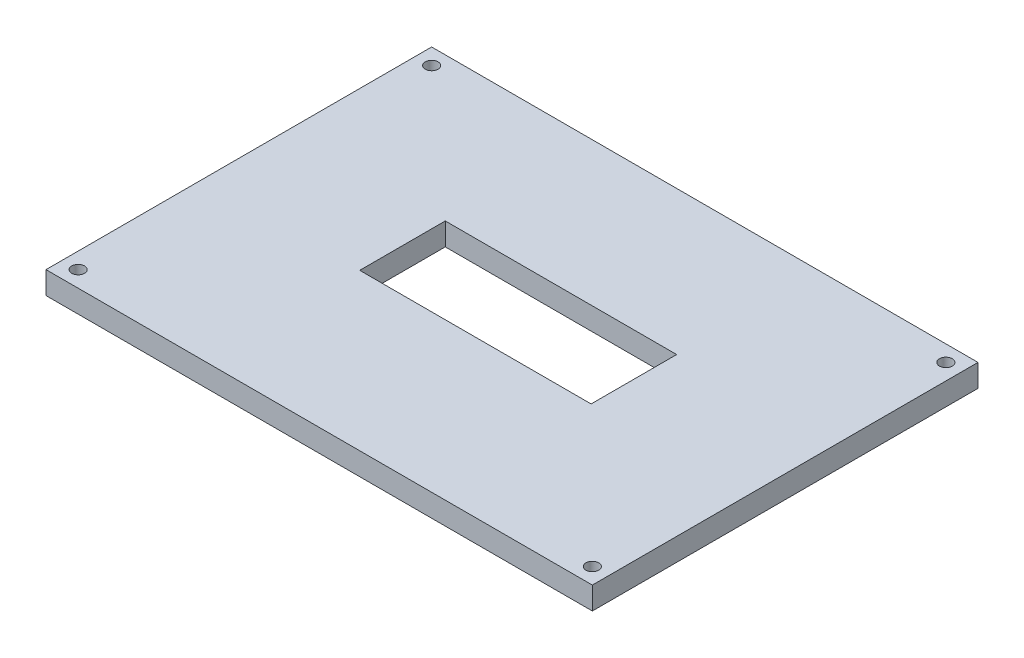
ISO-10303-21;
HEADER;
FILE_DESCRIPTION(('STEP AP214'),'2;1');
FILE_NAME('part.step','',(''),(''),'','','');
FILE_SCHEMA(('AUTOMOTIVE_DESIGN { 1 0 10303 214 1 1 1 1 }'));
ENDSEC;
DATA;
#1=APPLICATION_CONTEXT('core data for automotive mechanical design processes');
#2=APPLICATION_PROTOCOL_DEFINITION('international standard','automotive_design',2000,#1);
#3=PRODUCT_CONTEXT('',#1,'mechanical');
#4=PRODUCT('Part','Part','',(#3));
#5=PRODUCT_RELATED_PRODUCT_CATEGORY('part','',(#4));
#6=PRODUCT_DEFINITION_FORMATION('','',#4);
#7=PRODUCT_DEFINITION_CONTEXT('part definition',#1,'design');
#8=PRODUCT_DEFINITION('design','',#6,#7);
#9=PRODUCT_DEFINITION_SHAPE('','',#8);
#10=(LENGTH_UNIT() NAMED_UNIT(*) SI_UNIT(.MILLI.,.METRE.));
#11=(NAMED_UNIT(*) PLANE_ANGLE_UNIT() SI_UNIT($,.RADIAN.));
#12=(NAMED_UNIT(*) SI_UNIT($,.STERADIAN.) SOLID_ANGLE_UNIT());
#13=UNCERTAINTY_MEASURE_WITH_UNIT(LENGTH_MEASURE(1.E-05),#10,'distance_accuracy_value','');
#14=(GEOMETRIC_REPRESENTATION_CONTEXT(3) GLOBAL_UNCERTAINTY_ASSIGNED_CONTEXT((#13)) GLOBAL_UNIT_ASSIGNED_CONTEXT((#10,
#11,#12)) REPRESENTATION_CONTEXT('',''));
#15=CARTESIAN_POINT('',(0.,0.,0.));
#16=DIRECTION('',(0.,0.,1.));
#17=DIRECTION('',(1.,0.,0.));
#18=AXIS2_PLACEMENT_3D('',#15,#16,#17);
#19=CARTESIAN_POINT('',(-85.,7.,60.));
#20=DIRECTION('',(1.,0.,0.));
#21=DIRECTION('',(0.,0.,-1.));
#22=AXIS2_PLACEMENT_3D('',#19,#20,#21);
#23=PLANE('',#22);
#24=DIRECTION('',(0.,0.,1.));
#25=VECTOR('',#24,1.);
#26=CARTESIAN_POINT('',(-85.,0.,60.));
#27=LINE('',#26,#25);
#28=CARTESIAN_POINT('',(-85.,0.,-60.));
#29=VERTEX_POINT('',#28);
#30=CARTESIAN_POINT('',(-85.,0.,60.));
#31=VERTEX_POINT('',#30);
#32=EDGE_CURVE('E139',#29,#31,#27,.T.);
#33=ORIENTED_EDGE('',*,*,#32,.T.);
#34=DIRECTION('',(0.,-1.,0.));
#35=VECTOR('',#34,1.);
#36=CARTESIAN_POINT('',(-85.,7.,60.));
#37=LINE('',#36,#35);
#38=CARTESIAN_POINT('',(-85.,7.,60.));
#39=VERTEX_POINT('',#38);
#40=EDGE_CURVE('E11',#39,#31,#37,.T.);
#41=ORIENTED_EDGE('',*,*,#40,.F.);
#42=DIRECTION('',(0.,0.,1.));
#43=VECTOR('',#42,1.);
#44=CARTESIAN_POINT('',(-85.,7.,60.));
#45=LINE('',#44,#43);
#46=CARTESIAN_POINT('',(-85.,7.,-60.));
#47=VERTEX_POINT('',#46);
#48=EDGE_CURVE('E143',#47,#39,#45,.T.);
#49=ORIENTED_EDGE('',*,*,#48,.F.);
#50=DIRECTION('',(0.,-1.,0.));
#51=VECTOR('',#50,1.);
#52=CARTESIAN_POINT('',(-85.,7.,-60.));
#53=LINE('',#52,#51);
#54=EDGE_CURVE('E153',#47,#29,#53,.T.);
#55=ORIENTED_EDGE('',*,*,#54,.T.);
#56=EDGE_LOOP('',(#33,#41,#49,#55));
#57=FACE_BOUND('',#56,.T.);
#58=ADVANCED_FACE('F36',(#57),#23,.F.);
#59=CARTESIAN_POINT('',(85.,7.,60.));
#60=DIRECTION('',(0.,0.,-1.));
#61=DIRECTION('',(-1.,0.,0.));
#62=AXIS2_PLACEMENT_3D('',#59,#60,#61);
#63=PLANE('',#62);
#64=DIRECTION('',(1.,0.,0.));
#65=VECTOR('',#64,1.);
#66=CARTESIAN_POINT('',(85.,0.,60.));
#67=LINE('',#66,#65);
#68=CARTESIAN_POINT('',(85.,0.,60.));
#69=VERTEX_POINT('',#68);
#70=EDGE_CURVE('E156',#31,#69,#67,.T.);
#71=ORIENTED_EDGE('',*,*,#70,.T.);
#72=DIRECTION('',(0.,-1.,0.));
#73=VECTOR('',#72,1.);
#74=CARTESIAN_POINT('',(85.,7.,60.));
#75=LINE('',#74,#73);
#76=CARTESIAN_POINT('',(85.,7.,60.));
#77=VERTEX_POINT('',#76);
#78=EDGE_CURVE('E44',#77,#69,#75,.T.);
#79=ORIENTED_EDGE('',*,*,#78,.F.);
#80=DIRECTION('',(1.,0.,0.));
#81=VECTOR('',#80,1.);
#82=CARTESIAN_POINT('',(85.,7.,60.));
#83=LINE('',#82,#81);
#84=EDGE_CURVE('E146',#39,#77,#83,.T.);
#85=ORIENTED_EDGE('',*,*,#84,.F.);
#86=ORIENTED_EDGE('',*,*,#40,.T.);
#87=EDGE_LOOP('',(#71,#79,#85,#86));
#88=FACE_BOUND('',#87,.T.);
#89=ADVANCED_FACE('F209',(#88),#63,.F.);
#90=CARTESIAN_POINT('',(85.,7.,60.));
#91=DIRECTION('',(-1.,0.,0.));
#92=DIRECTION('',(0.,0.,1.));
#93=AXIS2_PLACEMENT_3D('',#90,#91,#92);
#94=PLANE('',#93);
#95=DIRECTION('',(0.,0.,-1.));
#96=VECTOR('',#95,1.);
#97=CARTESIAN_POINT('',(85.,0.,60.));
#98=LINE('',#97,#96);
#99=CARTESIAN_POINT('',(85.,0.,-60.));
#100=VERTEX_POINT('',#99);
#101=EDGE_CURVE('E158',#69,#100,#98,.T.);
#102=ORIENTED_EDGE('',*,*,#101,.T.);
#103=DIRECTION('',(0.,-1.,0.));
#104=VECTOR('',#103,1.);
#105=CARTESIAN_POINT('',(85.,7.,-60.));
#106=LINE('',#105,#104);
#107=CARTESIAN_POINT('',(85.,7.,-60.));
#108=VERTEX_POINT('',#107);
#109=EDGE_CURVE('E163',#108,#100,#106,.T.);
#110=ORIENTED_EDGE('',*,*,#109,.F.);
#111=DIRECTION('',(0.,0.,-1.));
#112=VECTOR('',#111,1.);
#113=CARTESIAN_POINT('',(85.,7.,60.));
#114=LINE('',#113,#112);
#115=EDGE_CURVE('E149',#77,#108,#114,.T.);
#116=ORIENTED_EDGE('',*,*,#115,.F.);
#117=ORIENTED_EDGE('',*,*,#78,.T.);
#118=EDGE_LOOP('',(#102,#110,#116,#117));
#119=FACE_BOUND('',#118,.T.);
#120=ADVANCED_FACE('F214',(#119),#94,.F.);
#121=CARTESIAN_POINT('',(85.,7.,-60.));
#122=DIRECTION('',(0.,0.,1.));
#123=DIRECTION('',(1.,0.,0.));
#124=AXIS2_PLACEMENT_3D('',#121,#122,#123);
#125=PLANE('',#124);
#126=DIRECTION('',(-1.,0.,0.));
#127=VECTOR('',#126,1.);
#128=CARTESIAN_POINT('',(85.,0.,-60.));
#129=LINE('',#128,#127);
#130=EDGE_CURVE('E147',#100,#29,#129,.T.);
#131=ORIENTED_EDGE('',*,*,#130,.T.);
#132=ORIENTED_EDGE('',*,*,#54,.F.);
#133=DIRECTION('',(-1.,0.,0.));
#134=VECTOR('',#133,1.);
#135=CARTESIAN_POINT('',(85.,7.,-60.));
#136=LINE('',#135,#134);
#137=EDGE_CURVE('E151',#108,#47,#136,.T.);
#138=ORIENTED_EDGE('',*,*,#137,.F.);
#139=ORIENTED_EDGE('',*,*,#109,.T.);
#140=EDGE_LOOP('',(#131,#132,#138,#139));
#141=FACE_BOUND('',#140,.T.);
#142=ADVANCED_FACE('F196',(#141),#125,.F.);
#143=CARTESIAN_POINT('',(0.,7.,0.));
#144=DIRECTION('',(0.,1.,0.));
#145=DIRECTION('',(0.,0.,1.));
#146=AXIS2_PLACEMENT_3D('',#143,#144,#145);
#147=PLANE('',#146);
#148=CARTESIAN_POINT('',(80.,7.,55.));
#149=DIRECTION('',(0.,1.,0.));
#150=DIRECTION('',(0.,0.,1.));
#151=AXIS2_PLACEMENT_3D('',#148,#149,#150);
#152=CIRCLE('',#151,2.);
#153=CARTESIAN_POINT('',(80.,7.,57.));
#154=VERTEX_POINT('',#153);
#155=EDGE_CURVE('E183',#154,#154,#152,.T.);
#156=ORIENTED_EDGE('',*,*,#155,.F.);
#157=EDGE_LOOP('',(#156));
#158=FACE_BOUND('',#157,.T.);
#159=CARTESIAN_POINT('',(80.,7.,-55.));
#160=DIRECTION('',(0.,1.,0.));
#161=DIRECTION('',(0.,0.,1.));
#162=AXIS2_PLACEMENT_3D('',#159,#160,#161);
#163=CIRCLE('',#162,2.);
#164=CARTESIAN_POINT('',(80.,7.,-53.));
#165=VERTEX_POINT('',#164);
#166=EDGE_CURVE('E173',#165,#165,#163,.T.);
#167=ORIENTED_EDGE('',*,*,#166,.F.);
#168=EDGE_LOOP('',(#167));
#169=FACE_BOUND('',#168,.T.);
#170=CARTESIAN_POINT('',(-80.,7.,55.));
#171=DIRECTION('',(0.,1.,0.));
#172=DIRECTION('',(0.,0.,1.));
#173=AXIS2_PLACEMENT_3D('',#170,#171,#172);
#174=CIRCLE('',#173,2.);
#175=CARTESIAN_POINT('',(-80.,7.,57.));
#176=VERTEX_POINT('',#175);
#177=EDGE_CURVE('E170',#176,#176,#174,.T.);
#178=ORIENTED_EDGE('',*,*,#177,.F.);
#179=EDGE_LOOP('',(#178));
#180=FACE_BOUND('',#179,.T.);
#181=CARTESIAN_POINT('',(-80.,7.,-55.));
#182=DIRECTION('',(0.,1.,0.));
#183=DIRECTION('',(0.,0.,1.));
#184=AXIS2_PLACEMENT_3D('',#181,#182,#183);
#185=CIRCLE('',#184,2.);
#186=CARTESIAN_POINT('',(-80.,7.,-53.));
#187=VERTEX_POINT('',#186);
#188=EDGE_CURVE('E126',#187,#187,#185,.T.);
#189=ORIENTED_EDGE('',*,*,#188,.F.);
#190=EDGE_LOOP('',(#189));
#191=FACE_BOUND('',#190,.T.);
#192=DIRECTION('',(0.,0.,-1.));
#193=VECTOR('',#192,1.);
#194=CARTESIAN_POINT('',(36.,7.,-15.2367721667));
#195=LINE('',#194,#193);
#196=CARTESIAN_POINT('',(36.,7.,11.3837952969598));
#197=VERTEX_POINT('',#196);
#198=CARTESIAN_POINT('',(36.,7.,-15.2367721667));
#199=VERTEX_POINT('',#198);
#200=EDGE_CURVE('E52',#197,#199,#195,.T.);
#201=ORIENTED_EDGE('',*,*,#200,.F.);
#202=DIRECTION('',(1.,0.,0.));
#203=VECTOR('',#202,1.);
#204=CARTESIAN_POINT('',(-36.,7.,11.3837952969598));
#205=LINE('',#204,#203);
#206=CARTESIAN_POINT('',(-36.,7.,11.3837952969598));
#207=VERTEX_POINT('',#206);
#208=EDGE_CURVE('E120',#207,#197,#205,.T.);
#209=ORIENTED_EDGE('',*,*,#208,.F.);
#210=DIRECTION('',(0.,0.,1.));
#211=VECTOR('',#210,1.);
#212=CARTESIAN_POINT('',(-36.,7.,-15.2367721667));
#213=LINE('',#212,#211);
#214=CARTESIAN_POINT('',(-36.,7.,-15.2367721667));
#215=VERTEX_POINT('',#214);
#216=EDGE_CURVE('E123',#215,#207,#213,.T.);
#217=ORIENTED_EDGE('',*,*,#216,.F.);
#218=DIRECTION('',(-1.,0.,0.));
#219=VECTOR('',#218,1.);
#220=CARTESIAN_POINT('',(-36.,7.,-15.2367721667));
#221=LINE('',#220,#219);
#222=EDGE_CURVE('E132',#199,#215,#221,.T.);
#223=ORIENTED_EDGE('',*,*,#222,.F.);
#224=EDGE_LOOP('',(#201,#209,#217,#223));
#225=FACE_BOUND('',#224,.T.);
#226=ORIENTED_EDGE('',*,*,#48,.T.);
#227=ORIENTED_EDGE('',*,*,#84,.T.);
#228=ORIENTED_EDGE('',*,*,#115,.T.);
#229=ORIENTED_EDGE('',*,*,#137,.T.);
#230=EDGE_LOOP('',(#226,#227,#228,#229));
#231=FACE_BOUND('',#230,.T.);
#232=ADVANCED_FACE('F193',(#158,#169,#180,#191,#225,#231),#147,.T.);
#233=CARTESIAN_POINT('',(0.,0.,0.));
#234=DIRECTION('',(0.,1.,0.));
#235=DIRECTION('',(0.,0.,1.));
#236=AXIS2_PLACEMENT_3D('',#233,#234,#235);
#237=PLANE('',#236);
#238=CARTESIAN_POINT('',(80.,0.,55.));
#239=DIRECTION('',(0.,1.,0.));
#240=DIRECTION('',(0.,0.,1.));
#241=AXIS2_PLACEMENT_3D('',#238,#239,#240);
#242=CIRCLE('',#241,2.);
#243=CARTESIAN_POINT('',(80.,0.,57.));
#244=VERTEX_POINT('',#243);
#245=EDGE_CURVE('E39',#244,#244,#242,.T.);
#246=ORIENTED_EDGE('',*,*,#245,.T.);
#247=EDGE_LOOP('',(#246));
#248=FACE_BOUND('',#247,.T.);
#249=CARTESIAN_POINT('',(80.,0.,-55.));
#250=DIRECTION('',(0.,1.,0.));
#251=DIRECTION('',(0.,0.,1.));
#252=AXIS2_PLACEMENT_3D('',#249,#250,#251);
#253=CIRCLE('',#252,2.);
#254=CARTESIAN_POINT('',(80.,0.,-53.));
#255=VERTEX_POINT('',#254);
#256=EDGE_CURVE('E171',#255,#255,#253,.T.);
#257=ORIENTED_EDGE('',*,*,#256,.T.);
#258=EDGE_LOOP('',(#257));
#259=FACE_BOUND('',#258,.T.);
#260=CARTESIAN_POINT('',(-80.,0.,55.));
#261=DIRECTION('',(0.,1.,0.));
#262=DIRECTION('',(0.,0.,1.));
#263=AXIS2_PLACEMENT_3D('',#260,#261,#262);
#264=CIRCLE('',#263,2.);
#265=CARTESIAN_POINT('',(-80.,0.,57.));
#266=VERTEX_POINT('',#265);
#267=EDGE_CURVE('E168',#266,#266,#264,.T.);
#268=ORIENTED_EDGE('',*,*,#267,.T.);
#269=EDGE_LOOP('',(#268));
#270=FACE_BOUND('',#269,.T.);
#271=CARTESIAN_POINT('',(-80.,0.,-55.));
#272=DIRECTION('',(0.,1.,0.));
#273=DIRECTION('',(0.,0.,1.));
#274=AXIS2_PLACEMENT_3D('',#271,#272,#273);
#275=CIRCLE('',#274,2.);
#276=CARTESIAN_POINT('',(-80.,0.,-53.));
#277=VERTEX_POINT('',#276);
#278=EDGE_CURVE('E133',#277,#277,#275,.T.);
#279=ORIENTED_EDGE('',*,*,#278,.T.);
#280=EDGE_LOOP('',(#279));
#281=FACE_BOUND('',#280,.T.);
#282=DIRECTION('',(1.,0.,0.));
#283=VECTOR('',#282,1.);
#284=CARTESIAN_POINT('',(-36.,0.,11.3837952969598));
#285=LINE('',#284,#283);
#286=CARTESIAN_POINT('',(-36.,0.,11.3837952969598));
#287=VERTEX_POINT('',#286);
#288=CARTESIAN_POINT('',(36.,0.,11.3837952969598));
#289=VERTEX_POINT('',#288);
#290=EDGE_CURVE('E110',#287,#289,#285,.T.);
#291=ORIENTED_EDGE('',*,*,#290,.T.);
#292=DIRECTION('',(0.,0.,-1.));
#293=VECTOR('',#292,1.);
#294=CARTESIAN_POINT('',(36.,0.,-15.2367721667));
#295=LINE('',#294,#293);
#296=CARTESIAN_POINT('',(36.,0.,-15.2367721667));
#297=VERTEX_POINT('',#296);
#298=EDGE_CURVE('E104',#289,#297,#295,.T.);
#299=ORIENTED_EDGE('',*,*,#298,.T.);
#300=DIRECTION('',(-1.,0.,0.));
#301=VECTOR('',#300,1.);
#302=CARTESIAN_POINT('',(-36.,0.,-15.2367721667));
#303=LINE('',#302,#301);
#304=CARTESIAN_POINT('',(-36.,0.,-15.2367721667));
#305=VERTEX_POINT('',#304);
#306=EDGE_CURVE('E113',#297,#305,#303,.T.);
#307=ORIENTED_EDGE('',*,*,#306,.T.);
#308=DIRECTION('',(0.,0.,1.));
#309=VECTOR('',#308,1.);
#310=CARTESIAN_POINT('',(-36.,0.,-15.2367721667));
#311=LINE('',#310,#309);
#312=EDGE_CURVE('E60',#305,#287,#311,.T.);
#313=ORIENTED_EDGE('',*,*,#312,.T.);
#314=EDGE_LOOP('',(#291,#299,#307,#313));
#315=FACE_BOUND('',#314,.T.);
#316=ORIENTED_EDGE('',*,*,#32,.F.);
#317=ORIENTED_EDGE('',*,*,#130,.F.);
#318=ORIENTED_EDGE('',*,*,#101,.F.);
#319=ORIENTED_EDGE('',*,*,#70,.F.);
#320=EDGE_LOOP('',(#316,#317,#318,#319));
#321=FACE_BOUND('',#320,.T.);
#322=ADVANCED_FACE('F117',(#248,#259,#270,#281,#315,#321),#237,.F.);
#323=CARTESIAN_POINT('',(36.,0.,-15.2367721667));
#324=DIRECTION('',(1.,0.,0.));
#325=DIRECTION('',(0.,0.,-1.));
#326=AXIS2_PLACEMENT_3D('',#323,#324,#325);
#327=PLANE('',#326);
#328=ORIENTED_EDGE('',*,*,#200,.T.);
#329=DIRECTION('',(0.,1.,0.));
#330=VECTOR('',#329,1.);
#331=CARTESIAN_POINT('',(36.,0.,-15.2367721667));
#332=LINE('',#331,#330);
#333=EDGE_CURVE('E100',#297,#199,#332,.T.);
#334=ORIENTED_EDGE('',*,*,#333,.F.);
#335=ORIENTED_EDGE('',*,*,#298,.F.);
#336=DIRECTION('',(0.,1.,0.));
#337=VECTOR('',#336,1.);
#338=CARTESIAN_POINT('',(36.,0.,11.3837952969598));
#339=LINE('',#338,#337);
#340=EDGE_CURVE('E137',#289,#197,#339,.T.);
#341=ORIENTED_EDGE('',*,*,#340,.T.);
#342=EDGE_LOOP('',(#328,#334,#335,#341));
#343=FACE_BOUND('',#342,.T.);
#344=ADVANCED_FACE('F102',(#343),#327,.F.);
#345=CARTESIAN_POINT('',(-36.,0.,11.3837952969598));
#346=DIRECTION('',(0.,0.,1.));
#347=DIRECTION('',(1.,0.,0.));
#348=AXIS2_PLACEMENT_3D('',#345,#346,#347);
#349=PLANE('',#348);
#350=ORIENTED_EDGE('',*,*,#208,.T.);
#351=ORIENTED_EDGE('',*,*,#340,.F.);
#352=ORIENTED_EDGE('',*,*,#290,.F.);
#353=DIRECTION('',(0.,1.,0.));
#354=VECTOR('',#353,1.);
#355=CARTESIAN_POINT('',(-36.,0.,11.3837952969598));
#356=LINE('',#355,#354);
#357=EDGE_CURVE('E140',#287,#207,#356,.T.);
#358=ORIENTED_EDGE('',*,*,#357,.T.);
#359=EDGE_LOOP('',(#350,#351,#352,#358));
#360=FACE_BOUND('',#359,.T.);
#361=ADVANCED_FACE('F223',(#360),#349,.F.);
#362=CARTESIAN_POINT('',(-36.,0.,-15.2367721667));
#363=DIRECTION('',(-1.,0.,0.));
#364=DIRECTION('',(0.,0.,1.));
#365=AXIS2_PLACEMENT_3D('',#362,#363,#364);
#366=PLANE('',#365);
#367=ORIENTED_EDGE('',*,*,#216,.T.);
#368=ORIENTED_EDGE('',*,*,#357,.F.);
#369=ORIENTED_EDGE('',*,*,#312,.F.);
#370=DIRECTION('',(0.,1.,0.));
#371=VECTOR('',#370,1.);
#372=CARTESIAN_POINT('',(-36.,0.,-15.2367721667));
#373=LINE('',#372,#371);
#374=EDGE_CURVE('E109',#305,#215,#373,.T.);
#375=ORIENTED_EDGE('',*,*,#374,.T.);
#376=EDGE_LOOP('',(#367,#368,#369,#375));
#377=FACE_BOUND('',#376,.T.);
#378=ADVANCED_FACE('F289',(#377),#366,.F.);
#379=CARTESIAN_POINT('',(-36.,0.,-15.2367721667));
#380=DIRECTION('',(0.,0.,-1.));
#381=DIRECTION('',(-1.,0.,0.));
#382=AXIS2_PLACEMENT_3D('',#379,#380,#381);
#383=PLANE('',#382);
#384=ORIENTED_EDGE('',*,*,#222,.T.);
#385=ORIENTED_EDGE('',*,*,#374,.F.);
#386=ORIENTED_EDGE('',*,*,#306,.F.);
#387=ORIENTED_EDGE('',*,*,#333,.T.);
#388=EDGE_LOOP('',(#384,#385,#386,#387));
#389=FACE_BOUND('',#388,.T.);
#390=ADVANCED_FACE('F114',(#389),#383,.F.);
#391=CARTESIAN_POINT('',(-80.,0.,-55.));
#392=DIRECTION('',(0.,1.,0.));
#393=DIRECTION('',(0.,0.,1.));
#394=AXIS2_PLACEMENT_3D('',#391,#392,#393);
#395=CYLINDRICAL_SURFACE('',#394,2.);
#396=ORIENTED_EDGE('',*,*,#278,.F.);
#397=EDGE_LOOP('',(#396));
#398=FACE_BOUND('',#397,.T.);
#399=ORIENTED_EDGE('',*,*,#188,.T.);
#400=EDGE_LOOP('',(#399));
#401=FACE_BOUND('',#400,.T.);
#402=ADVANCED_FACE('F191',(#398,#401),#395,.F.);
#403=CARTESIAN_POINT('',(-80.,-3.,55.));
#404=DIRECTION('',(0.,1.,0.));
#405=DIRECTION('',(0.,0.,1.));
#406=AXIS2_PLACEMENT_3D('',#403,#404,#405);
#407=CYLINDRICAL_SURFACE('',#406,2.);
#408=ORIENTED_EDGE('',*,*,#177,.T.);
#409=EDGE_LOOP('',(#408));
#410=FACE_BOUND('',#409,.T.);
#411=ORIENTED_EDGE('',*,*,#267,.F.);
#412=EDGE_LOOP('',(#411));
#413=FACE_BOUND('',#412,.T.);
#414=ADVANCED_FACE('F271',(#410,#413),#407,.F.);
#415=CARTESIAN_POINT('',(80.,-3.,-55.));
#416=DIRECTION('',(0.,1.,0.));
#417=DIRECTION('',(0.,0.,1.));
#418=AXIS2_PLACEMENT_3D('',#415,#416,#417);
#419=CYLINDRICAL_SURFACE('',#418,2.);
#420=ORIENTED_EDGE('',*,*,#166,.T.);
#421=EDGE_LOOP('',(#420));
#422=FACE_BOUND('',#421,.T.);
#423=ORIENTED_EDGE('',*,*,#256,.F.);
#424=EDGE_LOOP('',(#423));
#425=FACE_BOUND('',#424,.T.);
#426=ADVANCED_FACE('F250',(#422,#425),#419,.F.);
#427=CARTESIAN_POINT('',(80.,-3.,55.));
#428=DIRECTION('',(0.,1.,0.));
#429=DIRECTION('',(0.,0.,1.));
#430=AXIS2_PLACEMENT_3D('',#427,#428,#429);
#431=CYLINDRICAL_SURFACE('',#430,2.);
#432=ORIENTED_EDGE('',*,*,#155,.T.);
#433=EDGE_LOOP('',(#432));
#434=FACE_BOUND('',#433,.T.);
#435=ORIENTED_EDGE('',*,*,#245,.F.);
#436=EDGE_LOOP('',(#435));
#437=FACE_BOUND('',#436,.T.);
#438=ADVANCED_FACE('F260',(#434,#437),#431,.F.);
#439=CLOSED_SHELL('',(#58,#89,#120,#142,#232,#322,#344,#361,#378,#390,#402,#414,#426,#438));
#440=MANIFOLD_SOLID_BREP('B2',#439);
#441=ADVANCED_BREP_SHAPE_REPRESENTATION('',(#18,#440),#14);
#442=SHAPE_DEFINITION_REPRESENTATION(#9,#441);
ENDSEC;
END-ISO-10303-21;
